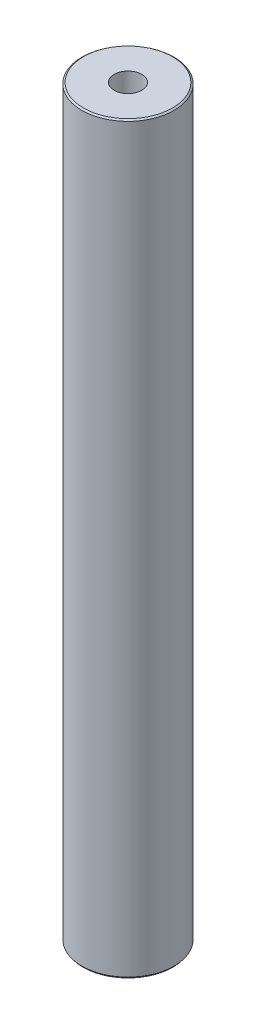
ISO-10303-21;
HEADER;
FILE_DESCRIPTION(('STEP AP214'),'2;1');
FILE_NAME('part.step','',(''),(''),'','','');
FILE_SCHEMA(('AUTOMOTIVE_DESIGN { 1 0 10303 214 1 1 1 1 }'));
ENDSEC;
DATA;
#1=APPLICATION_CONTEXT('core data for automotive mechanical design processes');
#2=APPLICATION_PROTOCOL_DEFINITION('international standard','automotive_design',2000,#1);
#3=PRODUCT_CONTEXT('',#1,'mechanical');
#4=PRODUCT('Part','Part','',(#3));
#5=PRODUCT_RELATED_PRODUCT_CATEGORY('part','',(#4));
#6=PRODUCT_DEFINITION_FORMATION('','',#4);
#7=PRODUCT_DEFINITION_CONTEXT('part definition',#1,'design');
#8=PRODUCT_DEFINITION('design','',#6,#7);
#9=PRODUCT_DEFINITION_SHAPE('','',#8);
#10=(LENGTH_UNIT() NAMED_UNIT(*) SI_UNIT(.MILLI.,.METRE.));
#11=(NAMED_UNIT(*) PLANE_ANGLE_UNIT() SI_UNIT($,.RADIAN.));
#12=(NAMED_UNIT(*) SI_UNIT($,.STERADIAN.) SOLID_ANGLE_UNIT());
#13=UNCERTAINTY_MEASURE_WITH_UNIT(LENGTH_MEASURE(1.E-05),#10,'distance_accuracy_value','');
#14=(GEOMETRIC_REPRESENTATION_CONTEXT(3) GLOBAL_UNCERTAINTY_ASSIGNED_CONTEXT((#13)) GLOBAL_UNIT_ASSIGNED_CONTEXT((#10,
#11,#12)) REPRESENTATION_CONTEXT('',''));
#15=CARTESIAN_POINT('',(0.,0.,0.));
#16=DIRECTION('',(0.,0.,1.));
#17=DIRECTION('',(1.,0.,0.));
#18=AXIS2_PLACEMENT_3D('',#15,#16,#17);
#19=CARTESIAN_POINT('',(0.,201.640800968248,0.));
#20=DIRECTION('',(0.,-1.,0.));
#21=DIRECTION('',(0.,0.,-1.));
#22=AXIS2_PLACEMENT_3D('',#19,#20,#21);
#23=CYLINDRICAL_SURFACE('',#22,12.5);
#24=CARTESIAN_POINT('',(0.,201.312311524386,0.));
#25=DIRECTION('',(0.,1.,0.));
#26=DIRECTION('',(0.,0.,1.));
#27=AXIS2_PLACEMENT_3D('',#24,#25,#26);
#28=CIRCLE('',#27,12.5);
#29=CARTESIAN_POINT('',(0.,201.312311524386,12.5));
#30=VERTEX_POINT('',#29);
#31=EDGE_CURVE('E50',#30,#30,#28,.F.);
#32=ORIENTED_EDGE('',*,*,#31,.T.);
#33=EDGE_LOOP('',(#32));
#34=FACE_BOUND('',#33,.T.);
#35=CARTESIAN_POINT('',(0.,0.438586034914312,0.));
#36=DIRECTION('',(0.,1.,0.));
#37=DIRECTION('',(0.,0.,1.));
#38=AXIS2_PLACEMENT_3D('',#35,#36,#37);
#39=CIRCLE('',#38,12.5);
#40=CARTESIAN_POINT('',(0.,0.438586034914312,12.5));
#41=VERTEX_POINT('',#40);
#42=EDGE_CURVE('E51',#41,#41,#39,.T.);
#43=ORIENTED_EDGE('',*,*,#42,.T.);
#44=EDGE_LOOP('',(#43));
#45=FACE_BOUND('',#44,.T.);
#46=ADVANCED_FACE('F39',(#34,#45),#23,.T.);
#47=CARTESIAN_POINT('',(0.,201.640800968248,0.));
#48=DIRECTION('',(0.,1.,0.));
#49=DIRECTION('',(0.,0.,1.));
#50=AXIS2_PLACEMENT_3D('',#47,#48,#49);
#51=PLANE('',#50);
#52=CARTESIAN_POINT('',(0.,201.640800968248,0.));
#53=DIRECTION('',(0.,1.,0.));
#54=DIRECTION('',(0.,0.,1.));
#55=AXIS2_PLACEMENT_3D('',#52,#53,#54);
#56=CIRCLE('',#55,12.0614139650857);
#57=CARTESIAN_POINT('',(0.,201.640800968248,12.0614139650857));
#58=VERTEX_POINT('',#57);
#59=EDGE_CURVE('E54',#58,#58,#56,.T.);
#60=ORIENTED_EDGE('',*,*,#59,.T.);
#61=EDGE_LOOP('',(#60));
#62=FACE_BOUND('',#61,.T.);
#63=CARTESIAN_POINT('',(0.,201.640800968248,0.));
#64=DIRECTION('',(0.,1.,0.));
#65=DIRECTION('',(0.,0.,1.));
#66=AXIS2_PLACEMENT_3D('',#63,#64,#65);
#67=CIRCLE('',#66,3.74849036308266);
#68=CARTESIAN_POINT('',(0.,201.640800968248,3.74849036308266));
#69=VERTEX_POINT('',#68);
#70=EDGE_CURVE('E58',#69,#69,#67,.T.);
#71=ORIENTED_EDGE('',*,*,#70,.F.);
#72=EDGE_LOOP('',(#71));
#73=FACE_BOUND('',#72,.T.);
#74=ADVANCED_FACE('F69',(#62,#73),#51,.T.);
#75=CARTESIAN_POINT('',(0.,0.,0.));
#76=DIRECTION('',(0.,1.,0.));
#77=DIRECTION('',(0.,0.,1.));
#78=AXIS2_PLACEMENT_3D('',#75,#76,#77);
#79=PLANE('',#78);
#80=CARTESIAN_POINT('',(0.,0.,0.));
#81=DIRECTION('',(0.,1.,0.));
#82=DIRECTION('',(0.,0.,1.));
#83=AXIS2_PLACEMENT_3D('',#80,#81,#82);
#84=CIRCLE('',#83,12.1715105561384);
#85=CARTESIAN_POINT('',(0.,0.,12.1715105561384));
#86=VERTEX_POINT('',#85);
#87=EDGE_CURVE('E10',#86,#86,#84,.F.);
#88=ORIENTED_EDGE('',*,*,#87,.T.);
#89=EDGE_LOOP('',(#88));
#90=FACE_BOUND('',#89,.T.);
#91=CARTESIAN_POINT('',(0.,0.,0.));
#92=DIRECTION('',(0.,1.,0.));
#93=DIRECTION('',(0.,0.,1.));
#94=AXIS2_PLACEMENT_3D('',#91,#92,#93);
#95=CIRCLE('',#94,3.74849036308266);
#96=CARTESIAN_POINT('',(0.,0.,3.74849036308266));
#97=VERTEX_POINT('',#96);
#98=EDGE_CURVE('E63',#97,#97,#95,.T.);
#99=ORIENTED_EDGE('',*,*,#98,.T.);
#100=EDGE_LOOP('',(#99));
#101=FACE_BOUND('',#100,.T.);
#102=ADVANCED_FACE('F75',(#90,#101),#79,.F.);
#103=CARTESIAN_POINT('',(0.,201.640800968248,0.));
#104=DIRECTION('',(0.,-1.,0.));
#105=DIRECTION('',(0.,0.,-1.));
#106=AXIS2_PLACEMENT_3D('',#103,#104,#105);
#107=CYLINDRICAL_SURFACE('',#106,3.74849036308266);
#108=ORIENTED_EDGE('',*,*,#70,.T.);
#109=EDGE_LOOP('',(#108));
#110=FACE_BOUND('',#109,.T.);
#111=ORIENTED_EDGE('',*,*,#98,.F.);
#112=EDGE_LOOP('',(#111));
#113=FACE_BOUND('',#112,.T.);
#114=ADVANCED_FACE('F70',(#110,#113),#107,.F.);
#115=CARTESIAN_POINT('',(0.,201.640800968248,0.));
#116=DIRECTION('',(0.,-1.,0.));
#117=DIRECTION('',(0.,0.,-1.));
#118=AXIS2_PLACEMENT_3D('',#115,#116,#117);
#119=CONICAL_SURFACE('',#118,12.0614139650857,0.927952317367568);
#120=ORIENTED_EDGE('',*,*,#31,.F.);
#121=EDGE_LOOP('',(#120));
#122=FACE_BOUND('',#121,.T.);
#123=ORIENTED_EDGE('',*,*,#59,.F.);
#124=EDGE_LOOP('',(#123));
#125=FACE_BOUND('',#124,.T.);
#126=ADVANCED_FACE('F81',(#122,#125),#119,.T.);
#127=CARTESIAN_POINT('',(0.,0.438586034914312,0.));
#128=DIRECTION('',(0.,1.,0.));
#129=DIRECTION('',(0.,0.,1.));
#130=AXIS2_PLACEMENT_3D('',#127,#128,#129);
#131=CONICAL_SURFACE('',#130,12.5,0.642844009427411);
#132=ORIENTED_EDGE('',*,*,#87,.F.);
#133=EDGE_LOOP('',(#132));
#134=FACE_BOUND('',#133,.T.);
#135=ORIENTED_EDGE('',*,*,#42,.F.);
#136=EDGE_LOOP('',(#135));
#137=FACE_BOUND('',#136,.T.);
#138=ADVANCED_FACE('F45',(#134,#137),#131,.T.);
#139=CLOSED_SHELL('',(#46,#74,#102,#114,#126,#138));
#140=MANIFOLD_SOLID_BREP('B2',#139);
#141=ADVANCED_BREP_SHAPE_REPRESENTATION('',(#18,#140),#14);
#142=SHAPE_DEFINITION_REPRESENTATION(#9,#141);
ENDSEC;
END-ISO-10303-21;
